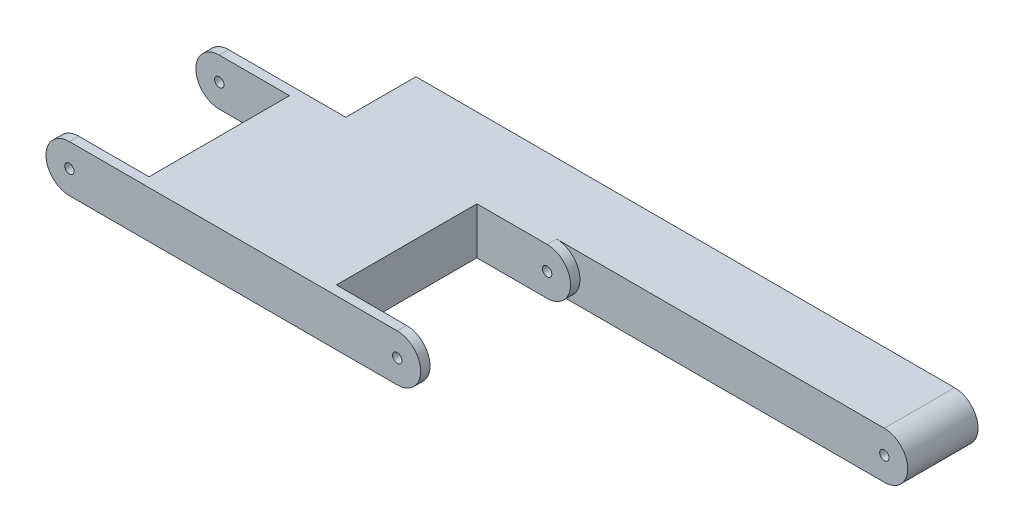
ISO-10303-21;
HEADER;
FILE_DESCRIPTION(('STEP AP214'),'2;1');
FILE_NAME('part.step','',(''),(''),'','','');
FILE_SCHEMA(('AUTOMOTIVE_DESIGN { 1 0 10303 214 1 1 1 1 }'));
ENDSEC;
DATA;
#1=APPLICATION_CONTEXT('core data for automotive mechanical design processes');
#2=APPLICATION_PROTOCOL_DEFINITION('international standard','automotive_design',2000,#1);
#3=PRODUCT_CONTEXT('',#1,'mechanical');
#4=PRODUCT('Part','Part','',(#3));
#5=PRODUCT_RELATED_PRODUCT_CATEGORY('part','',(#4));
#6=PRODUCT_DEFINITION_FORMATION('','',#4);
#7=PRODUCT_DEFINITION_CONTEXT('part definition',#1,'design');
#8=PRODUCT_DEFINITION('design','',#6,#7);
#9=PRODUCT_DEFINITION_SHAPE('','',#8);
#10=(LENGTH_UNIT() NAMED_UNIT(*) SI_UNIT(.MILLI.,.METRE.));
#11=(NAMED_UNIT(*) PLANE_ANGLE_UNIT() SI_UNIT($,.RADIAN.));
#12=(NAMED_UNIT(*) SI_UNIT($,.STERADIAN.) SOLID_ANGLE_UNIT());
#13=UNCERTAINTY_MEASURE_WITH_UNIT(LENGTH_MEASURE(1.E-05),#10,'distance_accuracy_value','');
#14=(GEOMETRIC_REPRESENTATION_CONTEXT(3) GLOBAL_UNCERTAINTY_ASSIGNED_CONTEXT((#13)) GLOBAL_UNIT_ASSIGNED_CONTEXT((#10,
#11,#12)) REPRESENTATION_CONTEXT('',''));
#15=CARTESIAN_POINT('',(0.,0.,0.));
#16=DIRECTION('',(0.,0.,1.));
#17=DIRECTION('',(1.,0.,0.));
#18=AXIS2_PLACEMENT_3D('',#15,#16,#17);
#19=CARTESIAN_POINT('',(105.,0.,-15.));
#20=DIRECTION('',(0.,0.,1.));
#21=DIRECTION('',(1.,0.,0.));
#22=AXIS2_PLACEMENT_3D('',#19,#20,#21);
#23=PLANE('',#22);
#24=DIRECTION('',(1.,0.,0.));
#25=VECTOR('',#24,1.);
#26=CARTESIAN_POINT('',(0.,-5.,-15.));
#27=LINE('',#26,#25);
#28=CARTESIAN_POINT('',(-10.,-5.,-15.));
#29=VERTEX_POINT('',#28);
#30=CARTESIAN_POINT('',(105.,-5.,-15.));
#31=VERTEX_POINT('',#30);
#32=EDGE_CURVE('E174',#29,#31,#27,.T.);
#33=ORIENTED_EDGE('',*,*,#32,.F.);
#34=DIRECTION('',(0.,1.,0.));
#35=VECTOR('',#34,1.);
#36=CARTESIAN_POINT('',(-10.,5.,-15.));
#37=LINE('',#36,#35);
#38=CARTESIAN_POINT('',(-10.,5.,-15.));
#39=VERTEX_POINT('',#38);
#40=EDGE_CURVE('E167',#29,#39,#37,.T.);
#41=ORIENTED_EDGE('',*,*,#40,.T.);
#42=DIRECTION('',(-1.,0.,0.));
#43=VECTOR('',#42,1.);
#44=CARTESIAN_POINT('',(0.,5.,-15.));
#45=LINE('',#44,#43);
#46=CARTESIAN_POINT('',(105.,5.,-15.));
#47=VERTEX_POINT('',#46);
#48=EDGE_CURVE('E150',#47,#39,#45,.T.);
#49=ORIENTED_EDGE('',*,*,#48,.F.);
#50=CARTESIAN_POINT('',(105.,0.,-15.));
#51=DIRECTION('',(0.,0.,1.));
#52=DIRECTION('',(1.,0.,0.));
#53=AXIS2_PLACEMENT_3D('',#50,#51,#52);
#54=CIRCLE('',#53,5.);
#55=EDGE_CURVE('E162',#31,#47,#54,.T.);
#56=ORIENTED_EDGE('',*,*,#55,.F.);
#57=EDGE_LOOP('',(#33,#41,#49,#56));
#58=FACE_BOUND('',#57,.T.);
#59=CARTESIAN_POINT('',(35.,0.,-15.));
#60=DIRECTION('',(0.,0.,1.));
#61=DIRECTION('',(1.,0.,0.));
#62=AXIS2_PLACEMENT_3D('',#59,#60,#61);
#63=CIRCLE('',#62,0.999999999999998);
#64=CARTESIAN_POINT('',(36.,0.,-15.));
#65=VERTEX_POINT('',#64);
#66=EDGE_CURVE('E186',#65,#65,#63,.T.);
#67=ORIENTED_EDGE('',*,*,#66,.T.);
#68=EDGE_LOOP('',(#67));
#69=FACE_BOUND('',#68,.T.);
#70=CARTESIAN_POINT('',(105.,0.,-15.));
#71=DIRECTION('',(0.,0.,1.));
#72=DIRECTION('',(1.,0.,0.));
#73=AXIS2_PLACEMENT_3D('',#70,#71,#72);
#74=CIRCLE('',#73,0.999999999999998);
#75=CARTESIAN_POINT('',(106.,0.,-15.));
#76=VERTEX_POINT('',#75);
#77=EDGE_CURVE('E183',#76,#76,#74,.F.);
#78=ORIENTED_EDGE('',*,*,#77,.F.);
#79=EDGE_LOOP('',(#78));
#80=FACE_BOUND('',#79,.T.);
#81=ADVANCED_FACE('F33',(#58,#69,#80),#23,.F.);
#82=CARTESIAN_POINT('',(105.,0.,0.));
#83=DIRECTION('',(0.,0.,1.));
#84=DIRECTION('',(1.,0.,0.));
#85=AXIS2_PLACEMENT_3D('',#82,#83,#84);
#86=PLANE('',#85);
#87=CARTESIAN_POINT('',(35.,0.,0.));
#88=DIRECTION('',(0.,0.,1.));
#89=DIRECTION('',(1.,0.,0.));
#90=AXIS2_PLACEMENT_3D('',#87,#88,#89);
#91=CIRCLE('',#90,5.);
#92=CARTESIAN_POINT('',(35.,-5.,0.));
#93=VERTEX_POINT('',#92);
#94=CARTESIAN_POINT('',(35.,5.,0.));
#95=VERTEX_POINT('',#94);
#96=EDGE_CURVE('E231',#93,#95,#91,.T.);
#97=ORIENTED_EDGE('',*,*,#96,.F.);
#98=DIRECTION('',(1.,0.,0.));
#99=VECTOR('',#98,1.);
#100=CARTESIAN_POINT('',(0.,-5.,0.));
#101=LINE('',#100,#99);
#102=CARTESIAN_POINT('',(105.,-5.,0.));
#103=VERTEX_POINT('',#102);
#104=EDGE_CURVE('E195',#93,#103,#101,.T.);
#105=ORIENTED_EDGE('',*,*,#104,.T.);
#106=CARTESIAN_POINT('',(105.,0.,0.));
#107=DIRECTION('',(0.,0.,1.));
#108=DIRECTION('',(1.,0.,0.));
#109=AXIS2_PLACEMENT_3D('',#106,#107,#108);
#110=CIRCLE('',#109,5.);
#111=CARTESIAN_POINT('',(105.,5.,0.));
#112=VERTEX_POINT('',#111);
#113=EDGE_CURVE('E192',#103,#112,#110,.T.);
#114=ORIENTED_EDGE('',*,*,#113,.T.);
#115=DIRECTION('',(-1.,0.,0.));
#116=VECTOR('',#115,1.);
#117=CARTESIAN_POINT('',(0.,5.,0.));
#118=LINE('',#117,#116);
#119=EDGE_CURVE('E188',#112,#95,#118,.T.);
#120=ORIENTED_EDGE('',*,*,#119,.T.);
#121=EDGE_LOOP('',(#97,#105,#114,#120));
#122=FACE_BOUND('',#121,.T.);
#123=CARTESIAN_POINT('',(105.,0.,0.));
#124=DIRECTION('',(0.,0.,-1.));
#125=DIRECTION('',(-1.,0.,0.));
#126=AXIS2_PLACEMENT_3D('',#123,#124,#125);
#127=CIRCLE('',#126,0.999999999999998);
#128=CARTESIAN_POINT('',(104.,0.,0.));
#129=VERTEX_POINT('',#128);
#130=EDGE_CURVE('E180',#129,#129,#127,.T.);
#131=ORIENTED_EDGE('',*,*,#130,.T.);
#132=EDGE_LOOP('',(#131));
#133=FACE_BOUND('',#132,.T.);
#134=ADVANCED_FACE('F217',(#122,#133),#86,.T.);
#135=CARTESIAN_POINT('',(-35.,-5.,34.));
#136=DIRECTION('',(0.,1.,0.));
#137=DIRECTION('',(0.,0.,1.));
#138=AXIS2_PLACEMENT_3D('',#135,#136,#137);
#139=PLANE('',#138);
#140=DIRECTION('',(1.,0.,0.));
#141=VECTOR('',#140,1.);
#142=CARTESIAN_POINT('',(-35.,-5.,2.));
#143=LINE('',#142,#141);
#144=CARTESIAN_POINT('',(20.,-5.,2.));
#145=VERTEX_POINT('',#144);
#146=CARTESIAN_POINT('',(35.,-5.,2.));
#147=VERTEX_POINT('',#146);
#148=EDGE_CURVE('E295',#145,#147,#143,.T.);
#149=ORIENTED_EDGE('',*,*,#148,.F.);
#150=DIRECTION('',(0.,0.,-1.));
#151=VECTOR('',#150,1.);
#152=CARTESIAN_POINT('',(20.,-5.,34.));
#153=LINE('',#152,#151);
#154=CARTESIAN_POINT('',(20.,-5.,32.));
#155=VERTEX_POINT('',#154);
#156=EDGE_CURVE('E297',#155,#145,#153,.T.);
#157=ORIENTED_EDGE('',*,*,#156,.F.);
#158=DIRECTION('',(-1.,0.,0.));
#159=VECTOR('',#158,1.);
#160=CARTESIAN_POINT('',(-35.,-5.,32.));
#161=LINE('',#160,#159);
#162=CARTESIAN_POINT('',(35.,-5.,32.));
#163=VERTEX_POINT('',#162);
#164=EDGE_CURVE('E282',#163,#155,#161,.T.);
#165=ORIENTED_EDGE('',*,*,#164,.F.);
#166=DIRECTION('',(0.,0.,-1.));
#167=VECTOR('',#166,1.);
#168=CARTESIAN_POINT('',(35.,-5.,34.));
#169=LINE('',#168,#167);
#170=CARTESIAN_POINT('',(35.,-5.,34.));
#171=VERTEX_POINT('',#170);
#172=EDGE_CURVE('E254',#171,#163,#169,.T.);
#173=ORIENTED_EDGE('',*,*,#172,.F.);
#174=DIRECTION('',(1.,0.,0.));
#175=VECTOR('',#174,1.);
#176=CARTESIAN_POINT('',(-35.,-5.,34.));
#177=LINE('',#176,#175);
#178=CARTESIAN_POINT('',(-35.,-5.,34.));
#179=VERTEX_POINT('',#178);
#180=EDGE_CURVE('E320',#179,#171,#177,.T.);
#181=ORIENTED_EDGE('',*,*,#180,.F.);
#182=DIRECTION('',(0.,0.,-1.));
#183=VECTOR('',#182,1.);
#184=CARTESIAN_POINT('',(-35.,-5.,34.));
#185=LINE('',#184,#183);
#186=CARTESIAN_POINT('',(-35.,-5.,32.));
#187=VERTEX_POINT('',#186);
#188=EDGE_CURVE('E258',#179,#187,#185,.T.);
#189=ORIENTED_EDGE('',*,*,#188,.T.);
#190=DIRECTION('',(-1.,0.,0.));
#191=VECTOR('',#190,1.);
#192=CARTESIAN_POINT('',(-35.,-5.,32.));
#193=LINE('',#192,#191);
#194=CARTESIAN_POINT('',(-20.,-5.,32.));
#195=VERTEX_POINT('',#194);
#196=EDGE_CURVE('E309',#195,#187,#193,.T.);
#197=ORIENTED_EDGE('',*,*,#196,.F.);
#198=DIRECTION('',(0.,0.,1.));
#199=VECTOR('',#198,1.);
#200=CARTESIAN_POINT('',(-20.,-5.,34.));
#201=LINE('',#200,#199);
#202=CARTESIAN_POINT('',(-20.,-5.,2.));
#203=VERTEX_POINT('',#202);
#204=EDGE_CURVE('E311',#203,#195,#201,.T.);
#205=ORIENTED_EDGE('',*,*,#204,.F.);
#206=DIRECTION('',(1.,0.,0.));
#207=VECTOR('',#206,1.);
#208=CARTESIAN_POINT('',(-35.,-5.,2.));
#209=LINE('',#208,#207);
#210=CARTESIAN_POINT('',(-35.,-5.,2.));
#211=VERTEX_POINT('',#210);
#212=EDGE_CURVE('E274',#211,#203,#209,.T.);
#213=ORIENTED_EDGE('',*,*,#212,.F.);
#214=CARTESIAN_POINT('',(-35.,-5.,0.));
#215=VERTEX_POINT('',#214);
#216=EDGE_CURVE('E257',#211,#215,#185,.T.);
#217=ORIENTED_EDGE('',*,*,#216,.T.);
#218=DIRECTION('',(1.,0.,0.));
#219=VECTOR('',#218,1.);
#220=CARTESIAN_POINT('',(-35.,-5.,0.));
#221=LINE('',#220,#219);
#222=CARTESIAN_POINT('',(-10.,-5.,0.));
#223=VERTEX_POINT('',#222);
#224=EDGE_CURVE('E234',#215,#223,#221,.T.);
#225=ORIENTED_EDGE('',*,*,#224,.T.);
#226=DIRECTION('',(0.,0.,-1.));
#227=VECTOR('',#226,1.);
#228=CARTESIAN_POINT('',(-10.,-5.,-15.));
#229=LINE('',#228,#227);
#230=EDGE_CURVE('E178',#223,#29,#229,.T.);
#231=ORIENTED_EDGE('',*,*,#230,.T.);
#232=ORIENTED_EDGE('',*,*,#32,.T.);
#233=DIRECTION('',(0.,0.,1.));
#234=VECTOR('',#233,1.);
#235=CARTESIAN_POINT('',(105.,-5.,-15.));
#236=LINE('',#235,#234);
#237=EDGE_CURVE('E161',#31,#103,#236,.T.);
#238=ORIENTED_EDGE('',*,*,#237,.T.);
#239=ORIENTED_EDGE('',*,*,#104,.F.);
#240=EDGE_CURVE('E233',#147,#93,#169,.T.);
#241=ORIENTED_EDGE('',*,*,#240,.F.);
#242=EDGE_LOOP('',(#149,#157,#165,#173,#181,#189,#197,#205,#213,#217,#225,#231,#232,#238,#239,#241));
#243=FACE_BOUND('',#242,.T.);
#244=ADVANCED_FACE('F212',(#243),#139,.F.);
#245=CARTESIAN_POINT('',(-35.,5.,34.));
#246=DIRECTION('',(0.,-1.,0.));
#247=DIRECTION('',(0.,0.,-1.));
#248=AXIS2_PLACEMENT_3D('',#245,#246,#247);
#249=PLANE('',#248);
#250=DIRECTION('',(0.,0.,1.));
#251=VECTOR('',#250,1.);
#252=CARTESIAN_POINT('',(-10.,5.,-15.));
#253=LINE('',#252,#251);
#254=CARTESIAN_POINT('',(-10.,5.,0.));
#255=VERTEX_POINT('',#254);
#256=EDGE_CURVE('E153',#39,#255,#253,.T.);
#257=ORIENTED_EDGE('',*,*,#256,.T.);
#258=DIRECTION('',(-1.,0.,0.));
#259=VECTOR('',#258,1.);
#260=CARTESIAN_POINT('',(-35.,5.,0.));
#261=LINE('',#260,#259);
#262=CARTESIAN_POINT('',(-35.,5.,0.));
#263=VERTEX_POINT('',#262);
#264=EDGE_CURVE('E37',#255,#263,#261,.T.);
#265=ORIENTED_EDGE('',*,*,#264,.T.);
#266=DIRECTION('',(0.,0.,-1.));
#267=VECTOR('',#266,1.);
#268=CARTESIAN_POINT('',(-35.,5.,34.));
#269=LINE('',#268,#267);
#270=CARTESIAN_POINT('',(-35.,5.,2.));
#271=VERTEX_POINT('',#270);
#272=EDGE_CURVE('E251',#271,#263,#269,.T.);
#273=ORIENTED_EDGE('',*,*,#272,.F.);
#274=DIRECTION('',(-1.,0.,0.));
#275=VECTOR('',#274,1.);
#276=CARTESIAN_POINT('',(-35.,5.,2.));
#277=LINE('',#276,#275);
#278=CARTESIAN_POINT('',(-20.,5.,2.));
#279=VERTEX_POINT('',#278);
#280=EDGE_CURVE('E268',#279,#271,#277,.T.);
#281=ORIENTED_EDGE('',*,*,#280,.F.);
#282=DIRECTION('',(0.,0.,-1.));
#283=VECTOR('',#282,1.);
#284=CARTESIAN_POINT('',(-20.,5.,34.));
#285=LINE('',#284,#283);
#286=CARTESIAN_POINT('',(-20.,5.,32.));
#287=VERTEX_POINT('',#286);
#288=EDGE_CURVE('E43',#287,#279,#285,.T.);
#289=ORIENTED_EDGE('',*,*,#288,.F.);
#290=DIRECTION('',(1.,0.,0.));
#291=VECTOR('',#290,1.);
#292=CARTESIAN_POINT('',(-35.,5.,32.));
#293=LINE('',#292,#291);
#294=CARTESIAN_POINT('',(-35.,5.,32.));
#295=VERTEX_POINT('',#294);
#296=EDGE_CURVE('E273',#295,#287,#293,.T.);
#297=ORIENTED_EDGE('',*,*,#296,.F.);
#298=CARTESIAN_POINT('',(-35.,5.,34.));
#299=VERTEX_POINT('',#298);
#300=EDGE_CURVE('E229',#299,#295,#269,.T.);
#301=ORIENTED_EDGE('',*,*,#300,.F.);
#302=DIRECTION('',(-1.,0.,0.));
#303=VECTOR('',#302,1.);
#304=CARTESIAN_POINT('',(-35.,5.,34.));
#305=LINE('',#304,#303);
#306=CARTESIAN_POINT('',(35.,5.,34.));
#307=VERTEX_POINT('',#306);
#308=EDGE_CURVE('E324',#307,#299,#305,.T.);
#309=ORIENTED_EDGE('',*,*,#308,.F.);
#310=DIRECTION('',(0.,0.,-1.));
#311=VECTOR('',#310,1.);
#312=CARTESIAN_POINT('',(35.,5.,34.));
#313=LINE('',#312,#311);
#314=CARTESIAN_POINT('',(35.,5.,32.));
#315=VERTEX_POINT('',#314);
#316=EDGE_CURVE('E228',#307,#315,#313,.T.);
#317=ORIENTED_EDGE('',*,*,#316,.T.);
#318=DIRECTION('',(1.,0.,0.));
#319=VECTOR('',#318,1.);
#320=CARTESIAN_POINT('',(-35.,5.,32.));
#321=LINE('',#320,#319);
#322=CARTESIAN_POINT('',(20.,5.,32.));
#323=VERTEX_POINT('',#322);
#324=EDGE_CURVE('E286',#323,#315,#321,.T.);
#325=ORIENTED_EDGE('',*,*,#324,.F.);
#326=DIRECTION('',(0.,0.,1.));
#327=VECTOR('',#326,1.);
#328=CARTESIAN_POINT('',(20.,5.,34.));
#329=LINE('',#328,#327);
#330=CARTESIAN_POINT('',(20.,5.,2.));
#331=VERTEX_POINT('',#330);
#332=EDGE_CURVE('E11',#331,#323,#329,.T.);
#333=ORIENTED_EDGE('',*,*,#332,.F.);
#334=DIRECTION('',(-1.,0.,0.));
#335=VECTOR('',#334,1.);
#336=CARTESIAN_POINT('',(-35.,5.,2.));
#337=LINE('',#336,#335);
#338=CARTESIAN_POINT('',(35.,5.,2.));
#339=VERTEX_POINT('',#338);
#340=EDGE_CURVE('E225',#339,#331,#337,.T.);
#341=ORIENTED_EDGE('',*,*,#340,.F.);
#342=EDGE_CURVE('E222',#339,#95,#313,.T.);
#343=ORIENTED_EDGE('',*,*,#342,.T.);
#344=ORIENTED_EDGE('',*,*,#119,.F.);
#345=DIRECTION('',(0.,0.,1.));
#346=VECTOR('',#345,1.);
#347=CARTESIAN_POINT('',(105.,5.,-15.));
#348=LINE('',#347,#346);
#349=EDGE_CURVE('E156',#47,#112,#348,.T.);
#350=ORIENTED_EDGE('',*,*,#349,.F.);
#351=ORIENTED_EDGE('',*,*,#48,.T.);
#352=EDGE_LOOP('',(#257,#265,#273,#281,#289,#297,#301,#309,#317,#325,#333,#341,#343,#344,#350,#351));
#353=FACE_BOUND('',#352,.T.);
#354=ADVANCED_FACE('F152',(#353),#249,.F.);
#355=CARTESIAN_POINT('',(35.,0.,34.));
#356=DIRECTION('',(0.,0.,-1.));
#357=DIRECTION('',(-1.,0.,0.));
#358=AXIS2_PLACEMENT_3D('',#355,#356,#357);
#359=CYLINDRICAL_SURFACE('',#358,5.);
#360=ORIENTED_EDGE('',*,*,#342,.F.);
#361=CARTESIAN_POINT('',(35.,0.,2.));
#362=DIRECTION('',(0.,0.,1.));
#363=DIRECTION('',(1.,0.,0.));
#364=AXIS2_PLACEMENT_3D('',#361,#362,#363);
#365=CIRCLE('',#364,5.);
#366=EDGE_CURVE('E281',#147,#339,#365,.T.);
#367=ORIENTED_EDGE('',*,*,#366,.F.);
#368=ORIENTED_EDGE('',*,*,#240,.T.);
#369=ORIENTED_EDGE('',*,*,#96,.T.);
#370=EDGE_LOOP('',(#360,#367,#368,#369));
#371=FACE_BOUND('',#370,.T.);
#372=ADVANCED_FACE('F232',(#371),#359,.T.);
#373=CARTESIAN_POINT('',(35.,0.,32.));
#374=DIRECTION('',(0.,0.,-1.));
#375=DIRECTION('',(-1.,0.,0.));
#376=AXIS2_PLACEMENT_3D('',#373,#374,#375);
#377=CIRCLE('',#376,5.);
#378=EDGE_CURVE('E51',#315,#163,#377,.T.);
#379=ORIENTED_EDGE('',*,*,#378,.F.);
#380=ORIENTED_EDGE('',*,*,#316,.F.);
#381=CARTESIAN_POINT('',(35.,0.,34.));
#382=DIRECTION('',(0.,0.,1.));
#383=DIRECTION('',(1.,0.,0.));
#384=AXIS2_PLACEMENT_3D('',#381,#382,#383);
#385=CIRCLE('',#384,5.);
#386=EDGE_CURVE('E322',#171,#307,#385,.T.);
#387=ORIENTED_EDGE('',*,*,#386,.F.);
#388=ORIENTED_EDGE('',*,*,#172,.T.);
#389=EDGE_LOOP('',(#379,#380,#387,#388));
#390=FACE_BOUND('',#389,.T.);
#391=ADVANCED_FACE('F358',(#390),#359,.T.);
#392=CARTESIAN_POINT('',(35.,0.,34.));
#393=DIRECTION('',(0.,0.,-1.));
#394=DIRECTION('',(-1.,0.,0.));
#395=AXIS2_PLACEMENT_3D('',#392,#393,#394);
#396=CYLINDRICAL_SURFACE('',#395,0.999999999999998);
#397=CARTESIAN_POINT('',(35.,0.,2.));
#398=DIRECTION('',(0.,0.,1.));
#399=DIRECTION('',(1.,0.,0.));
#400=AXIS2_PLACEMENT_3D('',#397,#398,#399);
#401=CIRCLE('',#400,0.999999999999998);
#402=CARTESIAN_POINT('',(36.,0.,2.));
#403=VERTEX_POINT('',#402);
#404=EDGE_CURVE('E279',#403,#403,#401,.T.);
#405=ORIENTED_EDGE('',*,*,#404,.T.);
#406=EDGE_LOOP('',(#405));
#407=FACE_BOUND('',#406,.T.);
#408=ORIENTED_EDGE('',*,*,#66,.F.);
#409=EDGE_LOOP('',(#408));
#410=FACE_BOUND('',#409,.T.);
#411=ADVANCED_FACE('F420',(#407,#410),#396,.F.);
#412=CARTESIAN_POINT('',(35.,0.,34.));
#413=DIRECTION('',(0.,0.,1.));
#414=DIRECTION('',(-1.,0.,0.));
#415=AXIS2_PLACEMENT_3D('',#412,#413,#414);
#416=CIRCLE('',#415,0.999999999999998);
#417=CARTESIAN_POINT('',(34.,0.,34.));
#418=VERTEX_POINT('',#417);
#419=EDGE_CURVE('E313',#418,#418,#416,.T.);
#420=ORIENTED_EDGE('',*,*,#419,.T.);
#421=EDGE_LOOP('',(#420));
#422=FACE_BOUND('',#421,.T.);
#423=CARTESIAN_POINT('',(35.,0.,32.));
#424=DIRECTION('',(0.,0.,-1.));
#425=DIRECTION('',(-1.,0.,0.));
#426=AXIS2_PLACEMENT_3D('',#423,#424,#425);
#427=CIRCLE('',#426,0.999999999999998);
#428=CARTESIAN_POINT('',(34.,0.,32.));
#429=VERTEX_POINT('',#428);
#430=EDGE_CURVE('E276',#429,#429,#427,.T.);
#431=ORIENTED_EDGE('',*,*,#430,.T.);
#432=EDGE_LOOP('',(#431));
#433=FACE_BOUND('',#432,.T.);
#434=ADVANCED_FACE('F424',(#422,#433),#396,.F.);
#435=CARTESIAN_POINT('',(-35.,0.,34.));
#436=DIRECTION('',(0.,0.,-1.));
#437=DIRECTION('',(-1.,0.,0.));
#438=AXIS2_PLACEMENT_3D('',#435,#436,#437);
#439=CYLINDRICAL_SURFACE('',#438,5.);
#440=ORIENTED_EDGE('',*,*,#300,.T.);
#441=CARTESIAN_POINT('',(-35.,0.,32.));
#442=DIRECTION('',(0.,0.,-1.));
#443=DIRECTION('',(-1.,0.,0.));
#444=AXIS2_PLACEMENT_3D('',#441,#442,#443);
#445=CIRCLE('',#444,5.);
#446=EDGE_CURVE('E307',#187,#295,#445,.T.);
#447=ORIENTED_EDGE('',*,*,#446,.F.);
#448=ORIENTED_EDGE('',*,*,#188,.F.);
#449=CARTESIAN_POINT('',(-35.,0.,34.));
#450=DIRECTION('',(0.,0.,1.));
#451=DIRECTION('',(1.,0.,0.));
#452=AXIS2_PLACEMENT_3D('',#449,#450,#451);
#453=CIRCLE('',#452,5.);
#454=EDGE_CURVE('E236',#299,#179,#453,.T.);
#455=ORIENTED_EDGE('',*,*,#454,.F.);
#456=EDGE_LOOP('',(#440,#447,#448,#455));
#457=FACE_BOUND('',#456,.T.);
#458=ADVANCED_FACE('F35',(#457),#439,.T.);
#459=CARTESIAN_POINT('',(-35.,0.,2.));
#460=DIRECTION('',(0.,0.,1.));
#461=DIRECTION('',(1.,0.,0.));
#462=AXIS2_PLACEMENT_3D('',#459,#460,#461);
#463=CIRCLE('',#462,5.);
#464=EDGE_CURVE('E303',#271,#211,#463,.T.);
#465=ORIENTED_EDGE('',*,*,#464,.F.);
#466=ORIENTED_EDGE('',*,*,#272,.T.);
#467=CARTESIAN_POINT('',(-35.,0.,0.));
#468=DIRECTION('',(0.,0.,1.));
#469=DIRECTION('',(1.,0.,0.));
#470=AXIS2_PLACEMENT_3D('',#467,#468,#469);
#471=CIRCLE('',#470,5.);
#472=EDGE_CURVE('E238',#263,#215,#471,.T.);
#473=ORIENTED_EDGE('',*,*,#472,.T.);
#474=ORIENTED_EDGE('',*,*,#216,.F.);
#475=EDGE_LOOP('',(#465,#466,#473,#474));
#476=FACE_BOUND('',#475,.T.);
#477=ADVANCED_FACE('F330',(#476),#439,.T.);
#478=CARTESIAN_POINT('',(-35.,0.,34.));
#479=DIRECTION('',(0.,0.,-1.));
#480=DIRECTION('',(-1.,0.,0.));
#481=AXIS2_PLACEMENT_3D('',#478,#479,#480);
#482=CYLINDRICAL_SURFACE('',#481,0.999999999999998);
#483=CARTESIAN_POINT('',(-35.,0.,34.));
#484=DIRECTION('',(0.,0.,1.));
#485=DIRECTION('',(1.,0.,0.));
#486=AXIS2_PLACEMENT_3D('',#483,#484,#485);
#487=CIRCLE('',#486,0.999999999999998);
#488=CARTESIAN_POINT('',(-34.,0.,34.));
#489=VERTEX_POINT('',#488);
#490=EDGE_CURVE('E264',#489,#489,#487,.T.);
#491=ORIENTED_EDGE('',*,*,#490,.T.);
#492=EDGE_LOOP('',(#491));
#493=FACE_BOUND('',#492,.T.);
#494=CARTESIAN_POINT('',(-35.,0.,32.));
#495=DIRECTION('',(0.,0.,-1.));
#496=DIRECTION('',(-1.,0.,0.));
#497=AXIS2_PLACEMENT_3D('',#494,#495,#496);
#498=CIRCLE('',#497,0.999999999999998);
#499=CARTESIAN_POINT('',(-36.,0.,32.));
#500=VERTEX_POINT('',#499);
#501=EDGE_CURVE('E270',#500,#500,#498,.T.);
#502=ORIENTED_EDGE('',*,*,#501,.T.);
#503=EDGE_LOOP('',(#502));
#504=FACE_BOUND('',#503,.T.);
#505=ADVANCED_FACE('F448',(#493,#504),#482,.F.);
#506=CARTESIAN_POINT('',(-35.,0.,0.));
#507=DIRECTION('',(0.,0.,1.));
#508=DIRECTION('',(1.,0.,0.));
#509=AXIS2_PLACEMENT_3D('',#506,#507,#508);
#510=CIRCLE('',#509,0.999999999999998);
#511=CARTESIAN_POINT('',(-34.,0.,0.));
#512=VERTEX_POINT('',#511);
#513=EDGE_CURVE('E261',#512,#512,#510,.F.);
#514=ORIENTED_EDGE('',*,*,#513,.T.);
#515=EDGE_LOOP('',(#514));
#516=FACE_BOUND('',#515,.T.);
#517=CARTESIAN_POINT('',(-35.,0.,2.));
#518=DIRECTION('',(0.,0.,1.));
#519=DIRECTION('',(1.,0.,0.));
#520=AXIS2_PLACEMENT_3D('',#517,#518,#519);
#521=CIRCLE('',#520,0.999999999999998);
#522=CARTESIAN_POINT('',(-34.,0.,2.));
#523=VERTEX_POINT('',#522);
#524=EDGE_CURVE('E265',#523,#523,#521,.T.);
#525=ORIENTED_EDGE('',*,*,#524,.T.);
#526=EDGE_LOOP('',(#525));
#527=FACE_BOUND('',#526,.T.);
#528=ADVANCED_FACE('F454',(#516,#527),#482,.F.);
#529=CARTESIAN_POINT('',(-35.,0.,34.));
#530=DIRECTION('',(0.,0.,1.));
#531=DIRECTION('',(1.,0.,0.));
#532=AXIS2_PLACEMENT_3D('',#529,#530,#531);
#533=PLANE('',#532);
#534=ORIENTED_EDGE('',*,*,#490,.F.);
#535=EDGE_LOOP('',(#534));
#536=FACE_BOUND('',#535,.T.);
#537=ORIENTED_EDGE('',*,*,#454,.T.);
#538=ORIENTED_EDGE('',*,*,#180,.T.);
#539=ORIENTED_EDGE('',*,*,#386,.T.);
#540=ORIENTED_EDGE('',*,*,#308,.T.);
#541=EDGE_LOOP('',(#537,#538,#539,#540));
#542=FACE_BOUND('',#541,.T.);
#543=ORIENTED_EDGE('',*,*,#419,.F.);
#544=EDGE_LOOP('',(#543));
#545=FACE_BOUND('',#544,.T.);
#546=ADVANCED_FACE('F353',(#536,#542,#545),#533,.T.);
#547=CARTESIAN_POINT('',(-35.,0.,0.));
#548=DIRECTION('',(0.,0.,1.));
#549=DIRECTION('',(1.,0.,0.));
#550=AXIS2_PLACEMENT_3D('',#547,#548,#549);
#551=PLANE('',#550);
#552=ORIENTED_EDGE('',*,*,#513,.F.);
#553=EDGE_LOOP('',(#552));
#554=FACE_BOUND('',#553,.T.);
#555=ORIENTED_EDGE('',*,*,#264,.F.);
#556=DIRECTION('',(0.,-1.,0.));
#557=VECTOR('',#556,1.);
#558=CARTESIAN_POINT('',(-10.,5.,0.));
#559=LINE('',#558,#557);
#560=EDGE_CURVE('E170',#255,#223,#559,.T.);
#561=ORIENTED_EDGE('',*,*,#560,.T.);
#562=ORIENTED_EDGE('',*,*,#224,.F.);
#563=ORIENTED_EDGE('',*,*,#472,.F.);
#564=EDGE_LOOP('',(#555,#561,#562,#563));
#565=FACE_BOUND('',#564,.T.);
#566=ADVANCED_FACE('F334',(#554,#565),#551,.F.);
#567=CARTESIAN_POINT('',(-20.,30.,2.));
#568=DIRECTION('',(-1.,0.,0.));
#569=DIRECTION('',(0.,0.,1.));
#570=AXIS2_PLACEMENT_3D('',#567,#568,#569);
#571=PLANE('',#570);
#572=ORIENTED_EDGE('',*,*,#204,.T.);
#573=DIRECTION('',(0.,-1.,0.));
#574=VECTOR('',#573,1.);
#575=CARTESIAN_POINT('',(-20.,30.,32.));
#576=LINE('',#575,#574);
#577=EDGE_CURVE('E269',#287,#195,#576,.T.);
#578=ORIENTED_EDGE('',*,*,#577,.F.);
#579=ORIENTED_EDGE('',*,*,#288,.T.);
#580=DIRECTION('',(0.,-1.,0.));
#581=VECTOR('',#580,1.);
#582=CARTESIAN_POINT('',(-20.,30.,2.));
#583=LINE('',#582,#581);
#584=EDGE_CURVE('E59',#279,#203,#583,.T.);
#585=ORIENTED_EDGE('',*,*,#584,.T.);
#586=EDGE_LOOP('',(#572,#578,#579,#585));
#587=FACE_BOUND('',#586,.T.);
#588=ADVANCED_FACE('F340',(#587),#571,.T.);
#589=CARTESIAN_POINT('',(-40.,30.,32.));
#590=DIRECTION('',(0.,0.,-1.));
#591=DIRECTION('',(-1.,0.,0.));
#592=AXIS2_PLACEMENT_3D('',#589,#590,#591);
#593=PLANE('',#592);
#594=ORIENTED_EDGE('',*,*,#501,.F.);
#595=EDGE_LOOP('',(#594));
#596=FACE_BOUND('',#595,.T.);
#597=ORIENTED_EDGE('',*,*,#196,.T.);
#598=ORIENTED_EDGE('',*,*,#446,.T.);
#599=ORIENTED_EDGE('',*,*,#296,.T.);
#600=ORIENTED_EDGE('',*,*,#577,.T.);
#601=EDGE_LOOP('',(#597,#598,#599,#600));
#602=FACE_BOUND('',#601,.T.);
#603=ADVANCED_FACE('F482',(#596,#602),#593,.T.);
#604=CARTESIAN_POINT('',(-40.,30.,2.));
#605=DIRECTION('',(0.,0.,1.));
#606=DIRECTION('',(1.,0.,0.));
#607=AXIS2_PLACEMENT_3D('',#604,#605,#606);
#608=PLANE('',#607);
#609=ORIENTED_EDGE('',*,*,#524,.F.);
#610=EDGE_LOOP('',(#609));
#611=FACE_BOUND('',#610,.T.);
#612=ORIENTED_EDGE('',*,*,#212,.T.);
#613=ORIENTED_EDGE('',*,*,#584,.F.);
#614=ORIENTED_EDGE('',*,*,#280,.T.);
#615=ORIENTED_EDGE('',*,*,#464,.T.);
#616=EDGE_LOOP('',(#612,#613,#614,#615));
#617=FACE_BOUND('',#616,.T.);
#618=ADVANCED_FACE('F338',(#611,#617),#608,.T.);
#619=CARTESIAN_POINT('',(20.,30.,2.));
#620=DIRECTION('',(1.,0.,0.));
#621=DIRECTION('',(0.,0.,-1.));
#622=AXIS2_PLACEMENT_3D('',#619,#620,#621);
#623=PLANE('',#622);
#624=ORIENTED_EDGE('',*,*,#156,.T.);
#625=DIRECTION('',(0.,-1.,0.));
#626=VECTOR('',#625,1.);
#627=CARTESIAN_POINT('',(20.,30.,2.));
#628=LINE('',#627,#626);
#629=EDGE_CURVE('E207',#331,#145,#628,.T.);
#630=ORIENTED_EDGE('',*,*,#629,.F.);
#631=ORIENTED_EDGE('',*,*,#332,.T.);
#632=DIRECTION('',(0.,-1.,0.));
#633=VECTOR('',#632,1.);
#634=CARTESIAN_POINT('',(20.,30.,32.));
#635=LINE('',#634,#633);
#636=EDGE_CURVE('E200',#323,#155,#635,.T.);
#637=ORIENTED_EDGE('',*,*,#636,.T.);
#638=EDGE_LOOP('',(#624,#630,#631,#637));
#639=FACE_BOUND('',#638,.T.);
#640=ADVANCED_FACE('F363',(#639),#623,.T.);
#641=CARTESIAN_POINT('',(40.,30.,2.));
#642=DIRECTION('',(0.,0.,1.));
#643=DIRECTION('',(1.,0.,0.));
#644=AXIS2_PLACEMENT_3D('',#641,#642,#643);
#645=PLANE('',#644);
#646=ORIENTED_EDGE('',*,*,#404,.F.);
#647=EDGE_LOOP('',(#646));
#648=FACE_BOUND('',#647,.T.);
#649=ORIENTED_EDGE('',*,*,#148,.T.);
#650=ORIENTED_EDGE('',*,*,#366,.T.);
#651=ORIENTED_EDGE('',*,*,#340,.T.);
#652=ORIENTED_EDGE('',*,*,#629,.T.);
#653=EDGE_LOOP('',(#649,#650,#651,#652));
#654=FACE_BOUND('',#653,.T.);
#655=ADVANCED_FACE('F365',(#648,#654),#645,.T.);
#656=CARTESIAN_POINT('',(40.,30.,32.));
#657=DIRECTION('',(0.,0.,-1.));
#658=DIRECTION('',(-1.,0.,0.));
#659=AXIS2_PLACEMENT_3D('',#656,#657,#658);
#660=PLANE('',#659);
#661=ORIENTED_EDGE('',*,*,#430,.F.);
#662=EDGE_LOOP('',(#661));
#663=FACE_BOUND('',#662,.T.);
#664=ORIENTED_EDGE('',*,*,#164,.T.);
#665=ORIENTED_EDGE('',*,*,#636,.F.);
#666=ORIENTED_EDGE('',*,*,#324,.T.);
#667=ORIENTED_EDGE('',*,*,#378,.T.);
#668=EDGE_LOOP('',(#664,#665,#666,#667));
#669=FACE_BOUND('',#668,.T.);
#670=ADVANCED_FACE('F366',(#663,#669),#660,.T.);
#671=CARTESIAN_POINT('',(105.,0.,-15.));
#672=DIRECTION('',(0.,0.,1.));
#673=DIRECTION('',(1.,0.,0.));
#674=AXIS2_PLACEMENT_3D('',#671,#672,#673);
#675=CYLINDRICAL_SURFACE('',#674,5.);
#676=ORIENTED_EDGE('',*,*,#113,.F.);
#677=ORIENTED_EDGE('',*,*,#237,.F.);
#678=ORIENTED_EDGE('',*,*,#55,.T.);
#679=ORIENTED_EDGE('',*,*,#349,.T.);
#680=EDGE_LOOP('',(#676,#677,#678,#679));
#681=FACE_BOUND('',#680,.T.);
#682=ADVANCED_FACE('F215',(#681),#675,.T.);
#683=CARTESIAN_POINT('',(105.,0.,-15.000025));
#684=DIRECTION('',(0.,0.,1.));
#685=DIRECTION('',(1.,0.,0.));
#686=AXIS2_PLACEMENT_3D('',#683,#684,#685);
#687=CYLINDRICAL_SURFACE('',#686,0.999999999999998);
#688=ORIENTED_EDGE('',*,*,#130,.F.);
#689=EDGE_LOOP('',(#688));
#690=FACE_BOUND('',#689,.T.);
#691=ORIENTED_EDGE('',*,*,#77,.T.);
#692=EDGE_LOOP('',(#691));
#693=FACE_BOUND('',#692,.T.);
#694=ADVANCED_FACE('F374',(#690,#693),#687,.F.);
#695=CARTESIAN_POINT('',(-10.,0.,0.));
#696=DIRECTION('',(-1.,0.,0.));
#697=DIRECTION('',(0.,0.,1.));
#698=AXIS2_PLACEMENT_3D('',#695,#696,#697);
#699=PLANE('',#698);
#700=ORIENTED_EDGE('',*,*,#40,.F.);
#701=ORIENTED_EDGE('',*,*,#230,.F.);
#702=ORIENTED_EDGE('',*,*,#560,.F.);
#703=ORIENTED_EDGE('',*,*,#256,.F.);
#704=EDGE_LOOP('',(#700,#701,#702,#703));
#705=FACE_BOUND('',#704,.T.);
#706=ADVANCED_FACE('F166',(#705),#699,.T.);
#707=CLOSED_SHELL('',(#81,#134,#244,#354,#372,#391,#411,#434,#458,#477,#505,#528,#546,#566,#588,
#603,#618,#640,#655,#670,#682,#694,#706));
#708=MANIFOLD_SOLID_BREP('B2',#707);
#709=ADVANCED_BREP_SHAPE_REPRESENTATION('',(#18,#708),#14);
#710=SHAPE_DEFINITION_REPRESENTATION(#9,#709);
ENDSEC;
END-ISO-10303-21;
